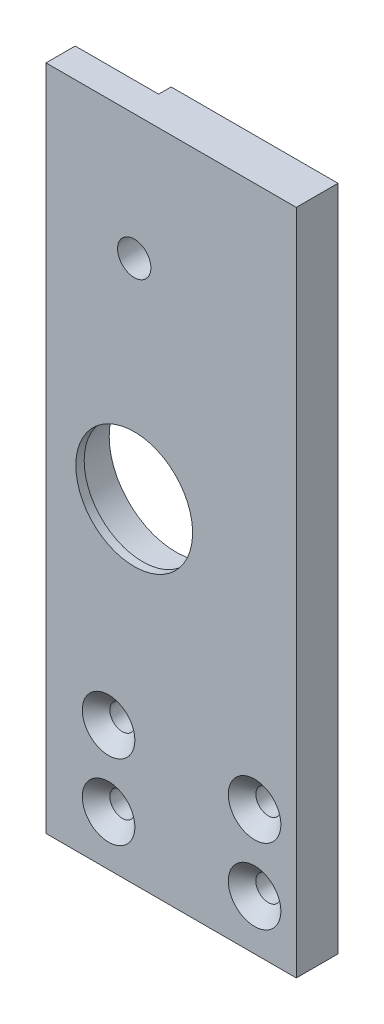
ISO-10303-21;
HEADER;
FILE_DESCRIPTION(('STEP AP214'),'2;1');
FILE_NAME('part.step','',(''),(''),'','','');
FILE_SCHEMA(('AUTOMOTIVE_DESIGN { 1 0 10303 214 1 1 1 1 }'));
ENDSEC;
DATA;
#1=APPLICATION_CONTEXT('core data for automotive mechanical design processes');
#2=APPLICATION_PROTOCOL_DEFINITION('international standard','automotive_design',2000,#1);
#3=PRODUCT_CONTEXT('',#1,'mechanical');
#4=PRODUCT('Part','Part','',(#3));
#5=PRODUCT_RELATED_PRODUCT_CATEGORY('part','',(#4));
#6=PRODUCT_DEFINITION_FORMATION('','',#4);
#7=PRODUCT_DEFINITION_CONTEXT('part definition',#1,'design');
#8=PRODUCT_DEFINITION('design','',#6,#7);
#9=PRODUCT_DEFINITION_SHAPE('','',#8);
#10=(LENGTH_UNIT() NAMED_UNIT(*) SI_UNIT(.MILLI.,.METRE.));
#11=(NAMED_UNIT(*) PLANE_ANGLE_UNIT() SI_UNIT($,.RADIAN.));
#12=(NAMED_UNIT(*) SI_UNIT($,.STERADIAN.) SOLID_ANGLE_UNIT());
#13=UNCERTAINTY_MEASURE_WITH_UNIT(LENGTH_MEASURE(1.E-05),#10,'distance_accuracy_value','');
#14=(GEOMETRIC_REPRESENTATION_CONTEXT(3) GLOBAL_UNCERTAINTY_ASSIGNED_CONTEXT((#13)) GLOBAL_UNIT_ASSIGNED_CONTEXT((#10,
#11,#12)) REPRESENTATION_CONTEXT('',''));
#15=CARTESIAN_POINT('',(0.,0.,0.));
#16=DIRECTION('',(0.,0.,1.));
#17=DIRECTION('',(1.,0.,0.));
#18=AXIS2_PLACEMENT_3D('',#15,#16,#17);
#19=CARTESIAN_POINT('',(0.,0.,10.));
#20=DIRECTION('',(0.,1.,0.));
#21=DIRECTION('',(0.,0.,1.));
#22=AXIS2_PLACEMENT_3D('',#19,#20,#21);
#23=PLANE('',#22);
#24=DIRECTION('',(0.,0.,-1.));
#25=VECTOR('',#24,1.);
#26=CARTESIAN_POINT('',(60.,0.,0.));
#27=LINE('',#26,#25);
#28=CARTESIAN_POINT('',(60.,0.,10.));
#29=VERTEX_POINT('',#28);
#30=CARTESIAN_POINT('',(60.,0.,0.));
#31=VERTEX_POINT('',#30);
#32=EDGE_CURVE('E49',#29,#31,#27,.T.);
#33=ORIENTED_EDGE('',*,*,#32,.F.);
#34=DIRECTION('',(1.,0.,0.));
#35=VECTOR('',#34,1.);
#36=CARTESIAN_POINT('',(0.,0.,10.));
#37=LINE('',#36,#35);
#38=CARTESIAN_POINT('',(0.,0.,10.));
#39=VERTEX_POINT('',#38);
#40=EDGE_CURVE('E119',#39,#29,#37,.T.);
#41=ORIENTED_EDGE('',*,*,#40,.F.);
#42=DIRECTION('',(0.,0.,-1.));
#43=VECTOR('',#42,1.);
#44=CARTESIAN_POINT('',(0.,0.,10.));
#45=LINE('',#44,#43);
#46=CARTESIAN_POINT('',(0.,0.,0.));
#47=VERTEX_POINT('',#46);
#48=EDGE_CURVE('E128',#39,#47,#45,.T.);
#49=ORIENTED_EDGE('',*,*,#48,.T.);
#50=DIRECTION('',(1.,0.,0.));
#51=VECTOR('',#50,1.);
#52=CARTESIAN_POINT('',(0.,0.,0.));
#53=LINE('',#52,#51);
#54=EDGE_CURVE('E116',#47,#31,#53,.T.);
#55=ORIENTED_EDGE('',*,*,#54,.T.);
#56=EDGE_LOOP('',(#33,#41,#49,#55));
#57=FACE_BOUND('',#56,.T.);
#58=ADVANCED_FACE('F34',(#57),#23,.F.);
#59=CARTESIAN_POINT('',(0.,160.,10.));
#60=DIRECTION('',(0.,-1.,0.));
#61=DIRECTION('',(0.,0.,-1.));
#62=AXIS2_PLACEMENT_3D('',#59,#60,#61);
#63=PLANE('',#62);
#64=DIRECTION('',(0.,0.,1.));
#65=VECTOR('',#64,1.);
#66=CARTESIAN_POINT('',(60.,160.,0.));
#67=LINE('',#66,#65);
#68=CARTESIAN_POINT('',(60.,160.,0.));
#69=VERTEX_POINT('',#68);
#70=CARTESIAN_POINT('',(60.,160.,10.));
#71=VERTEX_POINT('',#70);
#72=EDGE_CURVE('E94',#69,#71,#67,.T.);
#73=ORIENTED_EDGE('',*,*,#72,.F.);
#74=DIRECTION('',(-1.,0.,0.));
#75=VECTOR('',#74,1.);
#76=CARTESIAN_POINT('',(0.,160.,0.));
#77=LINE('',#76,#75);
#78=CARTESIAN_POINT('',(20.,160.,0.));
#79=VERTEX_POINT('',#78);
#80=EDGE_CURVE('E105',#69,#79,#77,.T.);
#81=ORIENTED_EDGE('',*,*,#80,.T.);
#82=DIRECTION('',(0.,0.,-1.));
#83=VECTOR('',#82,1.);
#84=CARTESIAN_POINT('',(20.,160.,0.));
#85=LINE('',#84,#83);
#86=CARTESIAN_POINT('',(20.,160.,3.));
#87=VERTEX_POINT('',#86);
#88=EDGE_CURVE('E462',#87,#79,#85,.T.);
#89=ORIENTED_EDGE('',*,*,#88,.F.);
#90=DIRECTION('',(1.,0.,0.));
#91=VECTOR('',#90,1.);
#92=CARTESIAN_POINT('',(0.,160.,3.));
#93=LINE('',#92,#91);
#94=CARTESIAN_POINT('',(0.,160.,3.));
#95=VERTEX_POINT('',#94);
#96=EDGE_CURVE('E457',#95,#87,#93,.T.);
#97=ORIENTED_EDGE('',*,*,#96,.F.);
#98=DIRECTION('',(0.,0.,-1.));
#99=VECTOR('',#98,1.);
#100=CARTESIAN_POINT('',(0.,160.,10.));
#101=LINE('',#100,#99);
#102=CARTESIAN_POINT('',(0.,160.,10.));
#103=VERTEX_POINT('',#102);
#104=EDGE_CURVE('E125',#103,#95,#101,.T.);
#105=ORIENTED_EDGE('',*,*,#104,.F.);
#106=DIRECTION('',(-1.,0.,0.));
#107=VECTOR('',#106,1.);
#108=CARTESIAN_POINT('',(0.,160.,10.));
#109=LINE('',#108,#107);
#110=EDGE_CURVE('E108',#71,#103,#109,.T.);
#111=ORIENTED_EDGE('',*,*,#110,.F.);
#112=EDGE_LOOP('',(#73,#81,#89,#97,#105,#111));
#113=FACE_BOUND('',#112,.T.);
#114=ADVANCED_FACE('F103',(#113),#63,.F.);
#115=CARTESIAN_POINT('',(0.,0.,10.));
#116=DIRECTION('',(0.,0.,-1.));
#117=DIRECTION('',(-1.,0.,0.));
#118=AXIS2_PLACEMENT_3D('',#115,#116,#117);
#119=PLANE('',#118);
#120=CARTESIAN_POINT('',(21.15,130.,10.));
#121=DIRECTION('',(0.,0.,-1.));
#122=DIRECTION('',(-1.,0.,0.));
#123=AXIS2_PLACEMENT_3D('',#120,#121,#122);
#124=CIRCLE('',#123,4.);
#125=CARTESIAN_POINT('',(17.15,130.,10.));
#126=VERTEX_POINT('',#125);
#127=EDGE_CURVE('E454',#126,#126,#124,.T.);
#128=ORIENTED_EDGE('',*,*,#127,.T.);
#129=EDGE_LOOP('',(#128));
#130=FACE_BOUND('',#129,.T.);
#131=CARTESIAN_POINT('',(21.15,80.,10.));
#132=DIRECTION('',(0.,0.,-1.));
#133=DIRECTION('',(-1.,0.,0.));
#134=AXIS2_PLACEMENT_3D('',#131,#132,#133);
#135=CIRCLE('',#134,14.);
#136=CARTESIAN_POINT('',(7.15000000000001,80.,10.));
#137=VERTEX_POINT('',#136);
#138=EDGE_CURVE('E448',#137,#137,#135,.T.);
#139=ORIENTED_EDGE('',*,*,#138,.T.);
#140=EDGE_LOOP('',(#139));
#141=FACE_BOUND('',#140,.T.);
#142=CARTESIAN_POINT('',(15.,12.,10.));
#143=DIRECTION('',(0.,0.,-1.));
#144=DIRECTION('',(-1.,0.,0.));
#145=AXIS2_PLACEMENT_3D('',#142,#143,#144);
#146=CIRCLE('',#145,6.30000000000001);
#147=CARTESIAN_POINT('',(8.69999999999996,12.,10.));
#148=VERTEX_POINT('',#147);
#149=EDGE_CURVE('E139',#148,#148,#146,.T.);
#150=ORIENTED_EDGE('',*,*,#149,.T.);
#151=EDGE_LOOP('',(#150));
#152=FACE_BOUND('',#151,.T.);
#153=CARTESIAN_POINT('',(50.,12.,10.));
#154=DIRECTION('',(0.,0.,-1.));
#155=DIRECTION('',(-1.,0.,0.));
#156=AXIS2_PLACEMENT_3D('',#153,#154,#155);
#157=CIRCLE('',#156,6.30000000000001);
#158=CARTESIAN_POINT('',(43.7,12.,10.));
#159=VERTEX_POINT('',#158);
#160=EDGE_CURVE('E148',#159,#159,#157,.T.);
#161=ORIENTED_EDGE('',*,*,#160,.T.);
#162=EDGE_LOOP('',(#161));
#163=FACE_BOUND('',#162,.T.);
#164=CARTESIAN_POINT('',(15.,30.,10.));
#165=DIRECTION('',(0.,0.,-1.));
#166=DIRECTION('',(-1.,0.,0.));
#167=AXIS2_PLACEMENT_3D('',#164,#165,#166);
#168=CIRCLE('',#167,6.30000000000001);
#169=CARTESIAN_POINT('',(8.69999999999996,30.,10.));
#170=VERTEX_POINT('',#169);
#171=EDGE_CURVE('E157',#170,#170,#168,.T.);
#172=ORIENTED_EDGE('',*,*,#171,.T.);
#173=EDGE_LOOP('',(#172));
#174=FACE_BOUND('',#173,.T.);
#175=CARTESIAN_POINT('',(50.,30.,10.));
#176=DIRECTION('',(0.,0.,-1.));
#177=DIRECTION('',(-1.,0.,0.));
#178=AXIS2_PLACEMENT_3D('',#175,#176,#177);
#179=CIRCLE('',#178,6.30000000000004);
#180=CARTESIAN_POINT('',(43.7,30.,10.));
#181=VERTEX_POINT('',#180);
#182=EDGE_CURVE('E11',#181,#181,#179,.T.);
#183=ORIENTED_EDGE('',*,*,#182,.T.);
#184=EDGE_LOOP('',(#183));
#185=FACE_BOUND('',#184,.T.);
#186=DIRECTION('',(0.,-1.,0.));
#187=VECTOR('',#186,1.);
#188=CARTESIAN_POINT('',(60.,0.,10.));
#189=LINE('',#188,#187);
#190=EDGE_CURVE('E109',#71,#29,#189,.T.);
#191=ORIENTED_EDGE('',*,*,#190,.F.);
#192=ORIENTED_EDGE('',*,*,#110,.T.);
#193=DIRECTION('',(0.,-1.,0.));
#194=VECTOR('',#193,1.);
#195=CARTESIAN_POINT('',(0.,0.,10.));
#196=LINE('',#195,#194);
#197=EDGE_CURVE('E115',#103,#39,#196,.T.);
#198=ORIENTED_EDGE('',*,*,#197,.T.);
#199=ORIENTED_EDGE('',*,*,#40,.T.);
#200=EDGE_LOOP('',(#191,#192,#198,#199));
#201=FACE_BOUND('',#200,.T.);
#202=ADVANCED_FACE('F184',(#130,#141,#152,#163,#174,#185,#201),#119,.F.);
#203=CARTESIAN_POINT('',(0.,0.,0.));
#204=DIRECTION('',(0.,0.,-1.));
#205=DIRECTION('',(-1.,0.,0.));
#206=AXIS2_PLACEMENT_3D('',#203,#204,#205);
#207=PLANE('',#206);
#208=CARTESIAN_POINT('',(21.15,80.,0.));
#209=DIRECTION('',(0.,0.,-1.));
#210=DIRECTION('',(-1.,0.,0.));
#211=AXIS2_PLACEMENT_3D('',#208,#209,#210);
#212=CIRCLE('',#211,16.);
#213=CARTESIAN_POINT('',(5.14999999999997,80.,0.));
#214=VERTEX_POINT('',#213);
#215=EDGE_CURVE('E472',#214,#214,#212,.T.);
#216=ORIENTED_EDGE('',*,*,#215,.F.);
#217=EDGE_LOOP('',(#216));
#218=FACE_BOUND('',#217,.T.);
#219=CARTESIAN_POINT('',(21.15,130.,0.));
#220=DIRECTION('',(0.,0.,-1.));
#221=DIRECTION('',(-1.,0.,0.));
#222=AXIS2_PLACEMENT_3D('',#219,#220,#221);
#223=CIRCLE('',#222,4.);
#224=CARTESIAN_POINT('',(17.15,130.,0.));
#225=VERTEX_POINT('',#224);
#226=EDGE_CURVE('E451',#225,#225,#223,.T.);
#227=ORIENTED_EDGE('',*,*,#226,.F.);
#228=EDGE_LOOP('',(#227));
#229=FACE_BOUND('',#228,.T.);
#230=CARTESIAN_POINT('',(15.,12.,0.));
#231=DIRECTION('',(0.,0.,-1.));
#232=DIRECTION('',(-1.,0.,0.));
#233=AXIS2_PLACEMENT_3D('',#230,#231,#232);
#234=CIRCLE('',#233,3.);
#235=CARTESIAN_POINT('',(12.,12.,0.));
#236=VERTEX_POINT('',#235);
#237=EDGE_CURVE('E132',#236,#236,#234,.T.);
#238=ORIENTED_EDGE('',*,*,#237,.F.);
#239=EDGE_LOOP('',(#238));
#240=FACE_BOUND('',#239,.T.);
#241=CARTESIAN_POINT('',(50.,12.,0.));
#242=DIRECTION('',(0.,0.,-1.));
#243=DIRECTION('',(-1.,0.,0.));
#244=AXIS2_PLACEMENT_3D('',#241,#242,#243);
#245=CIRCLE('',#244,3.);
#246=CARTESIAN_POINT('',(47.,12.,0.));
#247=VERTEX_POINT('',#246);
#248=EDGE_CURVE('E136',#247,#247,#245,.T.);
#249=ORIENTED_EDGE('',*,*,#248,.F.);
#250=EDGE_LOOP('',(#249));
#251=FACE_BOUND('',#250,.T.);
#252=CARTESIAN_POINT('',(15.,30.,0.));
#253=DIRECTION('',(0.,0.,-1.));
#254=DIRECTION('',(-1.,0.,0.));
#255=AXIS2_PLACEMENT_3D('',#252,#253,#254);
#256=CIRCLE('',#255,3.);
#257=CARTESIAN_POINT('',(12.,30.,0.));
#258=VERTEX_POINT('',#257);
#259=EDGE_CURVE('E145',#258,#258,#256,.T.);
#260=ORIENTED_EDGE('',*,*,#259,.F.);
#261=EDGE_LOOP('',(#260));
#262=FACE_BOUND('',#261,.T.);
#263=CARTESIAN_POINT('',(50.,30.,0.));
#264=DIRECTION('',(0.,0.,-1.));
#265=DIRECTION('',(-1.,0.,0.));
#266=AXIS2_PLACEMENT_3D('',#263,#264,#265);
#267=CIRCLE('',#266,3.);
#268=CARTESIAN_POINT('',(47.,30.,0.));
#269=VERTEX_POINT('',#268);
#270=EDGE_CURVE('E154',#269,#269,#267,.T.);
#271=ORIENTED_EDGE('',*,*,#270,.F.);
#272=EDGE_LOOP('',(#271));
#273=FACE_BOUND('',#272,.T.);
#274=ORIENTED_EDGE('',*,*,#80,.F.);
#275=DIRECTION('',(0.,1.,0.));
#276=VECTOR('',#275,1.);
#277=CARTESIAN_POINT('',(60.,0.,0.));
#278=LINE('',#277,#276);
#279=EDGE_CURVE('E91',#31,#69,#278,.T.);
#280=ORIENTED_EDGE('',*,*,#279,.F.);
#281=ORIENTED_EDGE('',*,*,#54,.F.);
#282=DIRECTION('',(0.,-1.,0.));
#283=VECTOR('',#282,1.);
#284=CARTESIAN_POINT('',(0.,0.,0.));
#285=LINE('',#284,#283);
#286=CARTESIAN_POINT('',(0.,145.,0.));
#287=VERTEX_POINT('',#286);
#288=EDGE_CURVE('E121',#287,#47,#285,.T.);
#289=ORIENTED_EDGE('',*,*,#288,.F.);
#290=DIRECTION('',(-1.,0.,0.));
#291=VECTOR('',#290,1.);
#292=CARTESIAN_POINT('',(0.,145.,0.));
#293=LINE('',#292,#291);
#294=CARTESIAN_POINT('',(20.,145.,0.));
#295=VERTEX_POINT('',#294);
#296=EDGE_CURVE('E465',#295,#287,#293,.T.);
#297=ORIENTED_EDGE('',*,*,#296,.F.);
#298=DIRECTION('',(0.,1.,0.));
#299=VECTOR('',#298,1.);
#300=CARTESIAN_POINT('',(20.,145.,0.));
#301=LINE('',#300,#299);
#302=EDGE_CURVE('E114',#295,#79,#301,.T.);
#303=ORIENTED_EDGE('',*,*,#302,.T.);
#304=EDGE_LOOP('',(#274,#280,#281,#289,#297,#303));
#305=FACE_BOUND('',#304,.T.);
#306=ADVANCED_FACE('F112',(#218,#229,#240,#251,#262,#273,#305),#207,.T.);
#307=CARTESIAN_POINT('',(0.,0.,10.));
#308=DIRECTION('',(1.,0.,0.));
#309=DIRECTION('',(0.,1.,0.));
#310=AXIS2_PLACEMENT_3D('',#307,#308,#309);
#311=PLANE('',#310);
#312=ORIENTED_EDGE('',*,*,#104,.T.);
#313=DIRECTION('',(0.,1.,0.));
#314=VECTOR('',#313,1.);
#315=CARTESIAN_POINT('',(0.,145.,3.));
#316=LINE('',#315,#314);
#317=CARTESIAN_POINT('',(0.,145.,3.));
#318=VERTEX_POINT('',#317);
#319=EDGE_CURVE('E467',#318,#95,#316,.T.);
#320=ORIENTED_EDGE('',*,*,#319,.F.);
#321=DIRECTION('',(0.,0.,1.));
#322=VECTOR('',#321,1.);
#323=CARTESIAN_POINT('',(0.,145.,0.));
#324=LINE('',#323,#322);
#325=EDGE_CURVE('E458',#287,#318,#324,.T.);
#326=ORIENTED_EDGE('',*,*,#325,.F.);
#327=ORIENTED_EDGE('',*,*,#288,.T.);
#328=ORIENTED_EDGE('',*,*,#48,.F.);
#329=ORIENTED_EDGE('',*,*,#197,.F.);
#330=EDGE_LOOP('',(#312,#320,#326,#327,#328,#329));
#331=FACE_BOUND('',#330,.T.);
#332=ADVANCED_FACE('F188',(#331),#311,.F.);
#333=CARTESIAN_POINT('',(21.15,80.,8.));
#334=DIRECTION('',(0.,0.,-1.));
#335=DIRECTION('',(-1.,0.,0.));
#336=AXIS2_PLACEMENT_3D('',#333,#334,#335);
#337=CYLINDRICAL_SURFACE('',#336,16.);
#338=CARTESIAN_POINT('',(21.15,80.,8.));
#339=DIRECTION('',(0.,0.,-1.));
#340=DIRECTION('',(-1.,0.,0.));
#341=AXIS2_PLACEMENT_3D('',#338,#339,#340);
#342=CIRCLE('',#341,16.);
#343=CARTESIAN_POINT('',(5.14999999999997,80.,8.));
#344=VERTEX_POINT('',#343);
#345=EDGE_CURVE('E476',#344,#344,#342,.T.);
#346=ORIENTED_EDGE('',*,*,#345,.F.);
#347=EDGE_LOOP('',(#346));
#348=FACE_BOUND('',#347,.T.);
#349=ORIENTED_EDGE('',*,*,#215,.T.);
#350=EDGE_LOOP('',(#349));
#351=FACE_BOUND('',#350,.T.);
#352=ADVANCED_FACE('F191',(#348,#351),#337,.F.);
#353=CARTESIAN_POINT('',(21.15,80.,8.));
#354=DIRECTION('',(0.,0.,-1.));
#355=DIRECTION('',(-1.,0.,0.));
#356=AXIS2_PLACEMENT_3D('',#353,#354,#355);
#357=PLANE('',#356);
#358=CARTESIAN_POINT('',(21.15,80.,8.));
#359=DIRECTION('',(0.,0.,-1.));
#360=DIRECTION('',(-1.,0.,0.));
#361=AXIS2_PLACEMENT_3D('',#358,#359,#360);
#362=CIRCLE('',#361,14.);
#363=CARTESIAN_POINT('',(7.15000000000001,80.,8.));
#364=VERTEX_POINT('',#363);
#365=EDGE_CURVE('E444',#364,#364,#362,.T.);
#366=ORIENTED_EDGE('',*,*,#365,.F.);
#367=EDGE_LOOP('',(#366));
#368=FACE_BOUND('',#367,.T.);
#369=ORIENTED_EDGE('',*,*,#345,.T.);
#370=EDGE_LOOP('',(#369));
#371=FACE_BOUND('',#370,.T.);
#372=ADVANCED_FACE('F231',(#368,#371),#357,.T.);
#373=CARTESIAN_POINT('',(20.,145.,0.));
#374=DIRECTION('',(1.,0.,0.));
#375=DIRECTION('',(0.,0.,-1.));
#376=AXIS2_PLACEMENT_3D('',#373,#374,#375);
#377=PLANE('',#376);
#378=ORIENTED_EDGE('',*,*,#88,.T.);
#379=ORIENTED_EDGE('',*,*,#302,.F.);
#380=DIRECTION('',(0.,0.,-1.));
#381=VECTOR('',#380,1.);
#382=CARTESIAN_POINT('',(20.,145.,0.));
#383=LINE('',#382,#381);
#384=CARTESIAN_POINT('',(20.,145.,3.));
#385=VERTEX_POINT('',#384);
#386=EDGE_CURVE('E57',#385,#295,#383,.T.);
#387=ORIENTED_EDGE('',*,*,#386,.F.);
#388=DIRECTION('',(0.,1.,0.));
#389=VECTOR('',#388,1.);
#390=CARTESIAN_POINT('',(20.,145.,3.));
#391=LINE('',#390,#389);
#392=EDGE_CURVE('E473',#385,#87,#391,.T.);
#393=ORIENTED_EDGE('',*,*,#392,.T.);
#394=EDGE_LOOP('',(#378,#379,#387,#393));
#395=FACE_BOUND('',#394,.T.);
#396=ADVANCED_FACE('F235',(#395),#377,.F.);
#397=CARTESIAN_POINT('',(0.,145.,3.));
#398=DIRECTION('',(0.,0.,1.));
#399=DIRECTION('',(1.,0.,0.));
#400=AXIS2_PLACEMENT_3D('',#397,#398,#399);
#401=PLANE('',#400);
#402=CARTESIAN_POINT('',(15.,151.,3.));
#403=DIRECTION('',(0.,0.,-1.));
#404=DIRECTION('',(-1.,0.,0.));
#405=AXIS2_PLACEMENT_3D('',#402,#403,#404);
#406=CIRCLE('',#405,1.61999999999999);
#407=CARTESIAN_POINT('',(13.38,151.,3.));
#408=VERTEX_POINT('',#407);
#409=EDGE_CURVE('E135',#408,#408,#406,.T.);
#410=ORIENTED_EDGE('',*,*,#409,.F.);
#411=EDGE_LOOP('',(#410));
#412=FACE_BOUND('',#411,.T.);
#413=CARTESIAN_POINT('',(5.,151.,3.));
#414=DIRECTION('',(0.,0.,-1.));
#415=DIRECTION('',(-1.,0.,0.));
#416=AXIS2_PLACEMENT_3D('',#413,#414,#415);
#417=CIRCLE('',#416,1.61999999999999);
#418=CARTESIAN_POINT('',(3.38000000000001,151.,3.));
#419=VERTEX_POINT('',#418);
#420=EDGE_CURVE('E433',#419,#419,#417,.T.);
#421=ORIENTED_EDGE('',*,*,#420,.F.);
#422=EDGE_LOOP('',(#421));
#423=FACE_BOUND('',#422,.T.);
#424=ORIENTED_EDGE('',*,*,#96,.T.);
#425=ORIENTED_EDGE('',*,*,#392,.F.);
#426=DIRECTION('',(1.,0.,0.));
#427=VECTOR('',#426,1.);
#428=CARTESIAN_POINT('',(0.,145.,3.));
#429=LINE('',#428,#427);
#430=EDGE_CURVE('E461',#318,#385,#429,.T.);
#431=ORIENTED_EDGE('',*,*,#430,.F.);
#432=ORIENTED_EDGE('',*,*,#319,.T.);
#433=EDGE_LOOP('',(#424,#425,#431,#432));
#434=FACE_BOUND('',#433,.T.);
#435=ADVANCED_FACE('F237',(#412,#423,#434),#401,.F.);
#436=CARTESIAN_POINT('',(0.,145.,0.));
#437=DIRECTION('',(0.,1.,0.));
#438=DIRECTION('',(0.,0.,1.));
#439=AXIS2_PLACEMENT_3D('',#436,#437,#438);
#440=PLANE('',#439);
#441=ORIENTED_EDGE('',*,*,#325,.T.);
#442=ORIENTED_EDGE('',*,*,#430,.T.);
#443=ORIENTED_EDGE('',*,*,#386,.T.);
#444=ORIENTED_EDGE('',*,*,#296,.T.);
#445=EDGE_LOOP('',(#441,#442,#443,#444));
#446=FACE_BOUND('',#445,.T.);
#447=ADVANCED_FACE('F240',(#446),#440,.T.);
#448=CARTESIAN_POINT('',(21.15,130.,20.));
#449=DIRECTION('',(0.,0.,-1.));
#450=DIRECTION('',(-1.,0.,0.));
#451=AXIS2_PLACEMENT_3D('',#448,#449,#450);
#452=CYLINDRICAL_SURFACE('',#451,4.);
#453=ORIENTED_EDGE('',*,*,#226,.T.);
#454=EDGE_LOOP('',(#453));
#455=FACE_BOUND('',#454,.T.);
#456=ORIENTED_EDGE('',*,*,#127,.F.);
#457=EDGE_LOOP('',(#456));
#458=FACE_BOUND('',#457,.T.);
#459=ADVANCED_FACE('F247',(#455,#458),#452,.F.);
#460=CARTESIAN_POINT('',(21.15,80.,28.));
#461=DIRECTION('',(0.,0.,-1.));
#462=DIRECTION('',(-1.,0.,0.));
#463=AXIS2_PLACEMENT_3D('',#460,#461,#462);
#464=CYLINDRICAL_SURFACE('',#463,14.);
#465=ORIENTED_EDGE('',*,*,#365,.T.);
#466=EDGE_LOOP('',(#465));
#467=FACE_BOUND('',#466,.T.);
#468=ORIENTED_EDGE('',*,*,#138,.F.);
#469=EDGE_LOOP('',(#468));
#470=FACE_BOUND('',#469,.T.);
#471=ADVANCED_FACE('F250',(#467,#470),#464,.F.);
#472=CARTESIAN_POINT('',(5.,151.,8.));
#473=DIRECTION('',(0.,0.,-1.));
#474=DIRECTION('',(-1.,0.,0.));
#475=AXIS2_PLACEMENT_3D('',#472,#473,#474);
#476=CYLINDRICAL_SURFACE('',#475,1.61999999999999);
#477=CARTESIAN_POINT('',(5.,151.,8.));
#478=DIRECTION('',(0.,0.,-1.));
#479=DIRECTION('',(-1.,0.,0.));
#480=AXIS2_PLACEMENT_3D('',#477,#478,#479);
#481=CIRCLE('',#480,1.61999999999999);
#482=CARTESIAN_POINT('',(3.38000000000001,151.,8.));
#483=VERTEX_POINT('',#482);
#484=EDGE_CURVE('E436',#483,#483,#481,.T.);
#485=ORIENTED_EDGE('',*,*,#484,.F.);
#486=EDGE_LOOP('',(#485));
#487=FACE_BOUND('',#486,.T.);
#488=ORIENTED_EDGE('',*,*,#420,.T.);
#489=EDGE_LOOP('',(#488));
#490=FACE_BOUND('',#489,.T.);
#491=ADVANCED_FACE('F254',(#487,#490),#476,.F.);
#492=CARTESIAN_POINT('',(5.,151.,8.));
#493=DIRECTION('',(0.,0.,-1.));
#494=DIRECTION('',(-1.,0.,0.));
#495=AXIS2_PLACEMENT_3D('',#492,#493,#494);
#496=PLANE('',#495);
#497=ORIENTED_EDGE('',*,*,#484,.T.);
#498=EDGE_LOOP('',(#497));
#499=FACE_BOUND('',#498,.T.);
#500=ADVANCED_FACE('F258',(#499),#496,.T.);
#501=CARTESIAN_POINT('',(15.,151.,8.));
#502=DIRECTION('',(0.,0.,-1.));
#503=DIRECTION('',(-1.,0.,0.));
#504=AXIS2_PLACEMENT_3D('',#501,#502,#503);
#505=CYLINDRICAL_SURFACE('',#504,1.61999999999999);
#506=CARTESIAN_POINT('',(15.,151.,8.));
#507=DIRECTION('',(0.,0.,-1.));
#508=DIRECTION('',(-1.,0.,0.));
#509=AXIS2_PLACEMENT_3D('',#506,#507,#508);
#510=CIRCLE('',#509,1.61999999999999);
#511=CARTESIAN_POINT('',(13.38,151.,8.));
#512=VERTEX_POINT('',#511);
#513=EDGE_CURVE('E432',#512,#512,#510,.T.);
#514=ORIENTED_EDGE('',*,*,#513,.F.);
#515=EDGE_LOOP('',(#514));
#516=FACE_BOUND('',#515,.T.);
#517=ORIENTED_EDGE('',*,*,#409,.T.);
#518=EDGE_LOOP('',(#517));
#519=FACE_BOUND('',#518,.T.);
#520=ADVANCED_FACE('F262',(#516,#519),#505,.F.);
#521=CARTESIAN_POINT('',(15.,151.,8.));
#522=DIRECTION('',(0.,0.,-1.));
#523=DIRECTION('',(-1.,0.,0.));
#524=AXIS2_PLACEMENT_3D('',#521,#522,#523);
#525=PLANE('',#524);
#526=ORIENTED_EDGE('',*,*,#513,.T.);
#527=EDGE_LOOP('',(#526));
#528=FACE_BOUND('',#527,.T.);
#529=ADVANCED_FACE('F266',(#528),#525,.T.);
#530=CARTESIAN_POINT('',(15.,12.,-22.));
#531=DIRECTION('',(0.,0.,1.));
#532=DIRECTION('',(1.,0.,0.));
#533=AXIS2_PLACEMENT_3D('',#530,#531,#532);
#534=CYLINDRICAL_SURFACE('',#533,3.);
#535=CARTESIAN_POINT('',(15.,12.,6.7));
#536=DIRECTION('',(0.,0.,-1.));
#537=DIRECTION('',(-1.,0.,0.));
#538=AXIS2_PLACEMENT_3D('',#535,#536,#537);
#539=CIRCLE('',#538,3.);
#540=CARTESIAN_POINT('',(12.,12.,6.7));
#541=VERTEX_POINT('',#540);
#542=EDGE_CURVE('E131',#541,#541,#539,.F.);
#543=ORIENTED_EDGE('',*,*,#542,.T.);
#544=EDGE_LOOP('',(#543));
#545=FACE_BOUND('',#544,.T.);
#546=ORIENTED_EDGE('',*,*,#237,.T.);
#547=EDGE_LOOP('',(#546));
#548=FACE_BOUND('',#547,.T.);
#549=ADVANCED_FACE('F197',(#545,#548),#534,.F.);
#550=CARTESIAN_POINT('',(15.,12.,6.7));
#551=DIRECTION('',(0.,0.,1.));
#552=DIRECTION('',(1.,0.,0.));
#553=AXIS2_PLACEMENT_3D('',#550,#551,#552);
#554=CONICAL_SURFACE('',#553,3.,0.785398163397451);
#555=ORIENTED_EDGE('',*,*,#149,.F.);
#556=EDGE_LOOP('',(#555));
#557=FACE_BOUND('',#556,.T.);
#558=ORIENTED_EDGE('',*,*,#542,.F.);
#559=EDGE_LOOP('',(#558));
#560=FACE_BOUND('',#559,.T.);
#561=ADVANCED_FACE('F193',(#557,#560),#554,.F.);
#562=CARTESIAN_POINT('',(50.,12.,-22.));
#563=DIRECTION('',(0.,0.,1.));
#564=DIRECTION('',(1.,0.,0.));
#565=AXIS2_PLACEMENT_3D('',#562,#563,#564);
#566=CYLINDRICAL_SURFACE('',#565,3.);
#567=CARTESIAN_POINT('',(50.,12.,6.7));
#568=DIRECTION('',(0.,0.,-1.));
#569=DIRECTION('',(-1.,0.,0.));
#570=AXIS2_PLACEMENT_3D('',#567,#568,#569);
#571=CIRCLE('',#570,3.);
#572=CARTESIAN_POINT('',(47.,12.,6.7));
#573=VERTEX_POINT('',#572);
#574=EDGE_CURVE('E142',#573,#573,#571,.F.);
#575=ORIENTED_EDGE('',*,*,#574,.T.);
#576=EDGE_LOOP('',(#575));
#577=FACE_BOUND('',#576,.T.);
#578=ORIENTED_EDGE('',*,*,#248,.T.);
#579=EDGE_LOOP('',(#578));
#580=FACE_BOUND('',#579,.T.);
#581=ADVANCED_FACE('F196',(#577,#580),#566,.F.);
#582=CARTESIAN_POINT('',(50.,12.,6.7));
#583=DIRECTION('',(0.,0.,1.));
#584=DIRECTION('',(1.,0.,0.));
#585=AXIS2_PLACEMENT_3D('',#582,#583,#584);
#586=CONICAL_SURFACE('',#585,3.,0.785398163397451);
#587=ORIENTED_EDGE('',*,*,#160,.F.);
#588=EDGE_LOOP('',(#587));
#589=FACE_BOUND('',#588,.T.);
#590=ORIENTED_EDGE('',*,*,#574,.F.);
#591=EDGE_LOOP('',(#590));
#592=FACE_BOUND('',#591,.T.);
#593=ADVANCED_FACE('F199',(#589,#592),#586,.F.);
#594=CARTESIAN_POINT('',(15.,30.,-22.));
#595=DIRECTION('',(0.,0.,1.));
#596=DIRECTION('',(1.,0.,0.));
#597=AXIS2_PLACEMENT_3D('',#594,#595,#596);
#598=CYLINDRICAL_SURFACE('',#597,3.);
#599=CARTESIAN_POINT('',(15.,30.,6.7));
#600=DIRECTION('',(0.,0.,-1.));
#601=DIRECTION('',(-1.,0.,0.));
#602=AXIS2_PLACEMENT_3D('',#599,#600,#601);
#603=CIRCLE('',#602,3.);
#604=CARTESIAN_POINT('',(12.,30.,6.7));
#605=VERTEX_POINT('',#604);
#606=EDGE_CURVE('E151',#605,#605,#603,.F.);
#607=ORIENTED_EDGE('',*,*,#606,.T.);
#608=EDGE_LOOP('',(#607));
#609=FACE_BOUND('',#608,.T.);
#610=ORIENTED_EDGE('',*,*,#259,.T.);
#611=EDGE_LOOP('',(#610));
#612=FACE_BOUND('',#611,.T.);
#613=ADVANCED_FACE('F201',(#609,#612),#598,.F.);
#614=CARTESIAN_POINT('',(15.,30.,6.7));
#615=DIRECTION('',(0.,0.,1.));
#616=DIRECTION('',(1.,0.,0.));
#617=AXIS2_PLACEMENT_3D('',#614,#615,#616);
#618=CONICAL_SURFACE('',#617,3.,0.785398163397451);
#619=ORIENTED_EDGE('',*,*,#171,.F.);
#620=EDGE_LOOP('',(#619));
#621=FACE_BOUND('',#620,.T.);
#622=ORIENTED_EDGE('',*,*,#606,.F.);
#623=EDGE_LOOP('',(#622));
#624=FACE_BOUND('',#623,.T.);
#625=ADVANCED_FACE('F175',(#621,#624),#618,.F.);
#626=CARTESIAN_POINT('',(50.,30.,-15.));
#627=DIRECTION('',(0.,0.,1.));
#628=DIRECTION('',(1.,0.,0.));
#629=AXIS2_PLACEMENT_3D('',#626,#627,#628);
#630=CYLINDRICAL_SURFACE('',#629,3.);
#631=CARTESIAN_POINT('',(50.,30.,6.69999999999998));
#632=DIRECTION('',(0.,0.,-1.));
#633=DIRECTION('',(-1.,0.,0.));
#634=AXIS2_PLACEMENT_3D('',#631,#632,#633);
#635=CIRCLE('',#634,3.);
#636=CARTESIAN_POINT('',(47.,30.,6.69999999999998));
#637=VERTEX_POINT('',#636);
#638=EDGE_CURVE('E42',#637,#637,#635,.F.);
#639=ORIENTED_EDGE('',*,*,#638,.T.);
#640=EDGE_LOOP('',(#639));
#641=FACE_BOUND('',#640,.T.);
#642=ORIENTED_EDGE('',*,*,#270,.T.);
#643=EDGE_LOOP('',(#642));
#644=FACE_BOUND('',#643,.T.);
#645=ADVANCED_FACE('F164',(#641,#644),#630,.F.);
#646=CARTESIAN_POINT('',(50.,30.,6.69999999999998));
#647=DIRECTION('',(0.,0.,1.));
#648=DIRECTION('',(1.,0.,0.));
#649=AXIS2_PLACEMENT_3D('',#646,#647,#648);
#650=CONICAL_SURFACE('',#649,3.,0.78539816339745);
#651=ORIENTED_EDGE('',*,*,#182,.F.);
#652=EDGE_LOOP('',(#651));
#653=FACE_BOUND('',#652,.T.);
#654=ORIENTED_EDGE('',*,*,#638,.F.);
#655=EDGE_LOOP('',(#654));
#656=FACE_BOUND('',#655,.T.);
#657=ADVANCED_FACE('F36',(#653,#656),#650,.F.);
#658=CARTESIAN_POINT('',(60.,0.,0.));
#659=DIRECTION('',(1.,0.,0.));
#660=DIRECTION('',(0.,1.,0.));
#661=AXIS2_PLACEMENT_3D('',#658,#659,#660);
#662=PLANE('',#661);
#663=ORIENTED_EDGE('',*,*,#279,.T.);
#664=ORIENTED_EDGE('',*,*,#72,.T.);
#665=ORIENTED_EDGE('',*,*,#190,.T.);
#666=ORIENTED_EDGE('',*,*,#32,.T.);
#667=EDGE_LOOP('',(#663,#664,#665,#666));
#668=FACE_BOUND('',#667,.T.);
#669=ADVANCED_FACE('F93',(#668),#662,.T.);
#670=CLOSED_SHELL('',(#58,#114,#202,#306,#332,#352,#372,#396,#435,#447,#459,#471,#491,#500,#520,
#529,#549,#561,#581,#593,#613,#625,#645,#657,#669));
#671=MANIFOLD_SOLID_BREP('B2',#670);
#672=ADVANCED_BREP_SHAPE_REPRESENTATION('',(#18,#671),#14);
#673=SHAPE_DEFINITION_REPRESENTATION(#9,#672);
ENDSEC;
END-ISO-10303-21;
